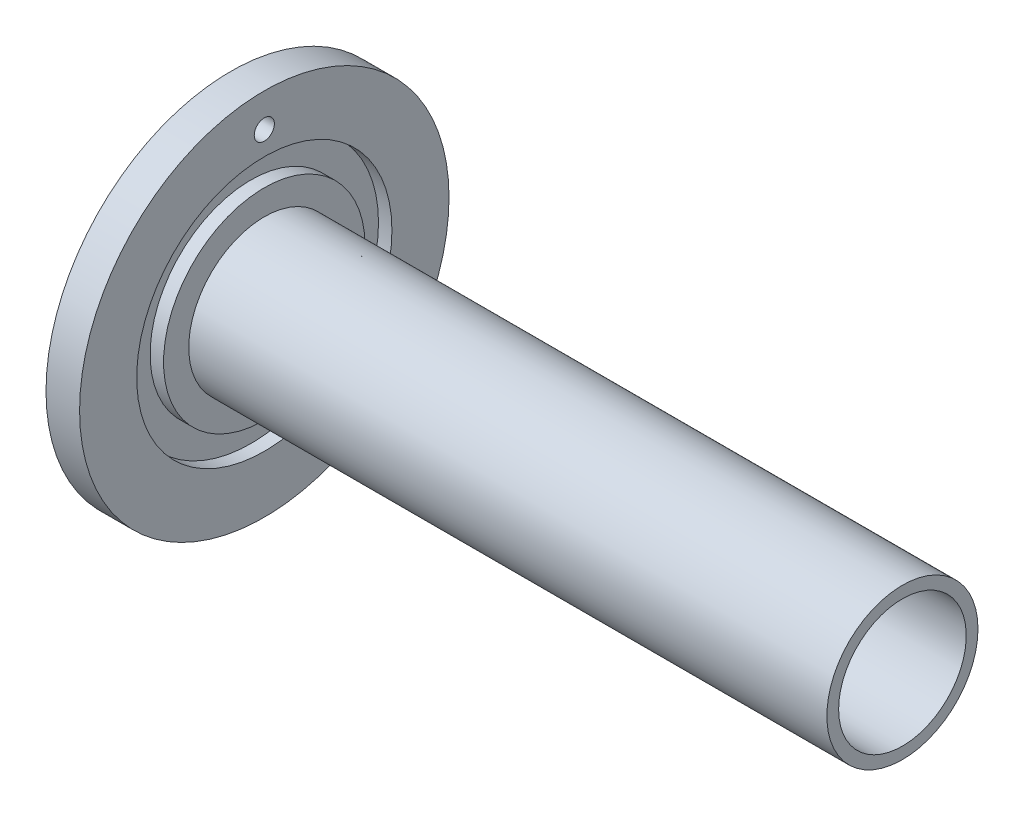
ISO-10303-21;
HEADER;
FILE_DESCRIPTION(('STEP AP214'),'2;1');
FILE_NAME('part.step','',(''),(''),'','','');
FILE_SCHEMA(('AUTOMOTIVE_DESIGN { 1 0 10303 214 1 1 1 1 }'));
ENDSEC;
DATA;
#1=APPLICATION_CONTEXT('core data for automotive mechanical design processes');
#2=APPLICATION_PROTOCOL_DEFINITION('international standard','automotive_design',2000,#1);
#3=PRODUCT_CONTEXT('',#1,'mechanical');
#4=PRODUCT('Part','Part','',(#3));
#5=PRODUCT_RELATED_PRODUCT_CATEGORY('part','',(#4));
#6=PRODUCT_DEFINITION_FORMATION('','',#4);
#7=PRODUCT_DEFINITION_CONTEXT('part definition',#1,'design');
#8=PRODUCT_DEFINITION('design','',#6,#7);
#9=PRODUCT_DEFINITION_SHAPE('','',#8);
#10=(LENGTH_UNIT() NAMED_UNIT(*) SI_UNIT(.MILLI.,.METRE.));
#11=(NAMED_UNIT(*) PLANE_ANGLE_UNIT() SI_UNIT($,.RADIAN.));
#12=(NAMED_UNIT(*) SI_UNIT($,.STERADIAN.) SOLID_ANGLE_UNIT());
#13=UNCERTAINTY_MEASURE_WITH_UNIT(LENGTH_MEASURE(1.E-05),#10,'distance_accuracy_value','');
#14=(GEOMETRIC_REPRESENTATION_CONTEXT(3) GLOBAL_UNCERTAINTY_ASSIGNED_CONTEXT((#13)) GLOBAL_UNIT_ASSIGNED_CONTEXT((#10,
#11,#12)) REPRESENTATION_CONTEXT('',''));
#15=CARTESIAN_POINT('',(0.,0.,0.));
#16=DIRECTION('',(0.,0.,1.));
#17=DIRECTION('',(1.,0.,0.));
#18=AXIS2_PLACEMENT_3D('',#15,#16,#17);
#19=CARTESIAN_POINT('',(1.,0.,0.));
#20=DIRECTION('',(-1.,0.,0.));
#21=DIRECTION('',(0.,0.,1.));
#22=AXIS2_PLACEMENT_3D('',#19,#20,#21);
#23=CYLINDRICAL_SURFACE('',#22,37.5);
#24=CARTESIAN_POINT('',(1.,0.,0.));
#25=DIRECTION('',(-1.,0.,0.));
#26=DIRECTION('',(0.,0.,1.));
#27=AXIS2_PLACEMENT_3D('',#24,#25,#26);
#28=CIRCLE('',#27,37.5);
#29=CARTESIAN_POINT('',(1.,-37.3125,3.74530956664458));
#30=VERTEX_POINT('',#29);
#31=CARTESIAN_POINT('',(1.,37.3125,3.74530956664458));
#32=VERTEX_POINT('',#31);
#33=EDGE_CURVE('E128',#30,#32,#28,.T.);
#34=ORIENTED_EDGE('',*,*,#33,.F.);
#35=DIRECTION('',(-1.,0.,0.));
#36=VECTOR('',#35,1.);
#37=CARTESIAN_POINT('',(1.,-37.3125,3.74530956664462));
#38=LINE('',#37,#36);
#39=CARTESIAN_POINT('',(0.,-37.3125,3.74530956664465));
#40=VERTEX_POINT('',#39);
#41=EDGE_CURVE('E125',#30,#40,#38,.T.);
#42=ORIENTED_EDGE('',*,*,#41,.T.);
#43=CARTESIAN_POINT('',(0.,0.,0.));
#44=DIRECTION('',(-1.,0.,0.));
#45=DIRECTION('',(0.,0.,1.));
#46=AXIS2_PLACEMENT_3D('',#43,#44,#45);
#47=CIRCLE('',#46,37.5);
#48=CARTESIAN_POINT('',(0.,37.3125,3.74530956664465));
#49=VERTEX_POINT('',#48);
#50=EDGE_CURVE('E119',#40,#49,#47,.T.);
#51=ORIENTED_EDGE('',*,*,#50,.T.);
#52=DIRECTION('',(-1.,0.,0.));
#53=VECTOR('',#52,1.);
#54=CARTESIAN_POINT('',(1.,37.3125,3.74530956664462));
#55=LINE('',#54,#53);
#56=EDGE_CURVE('E100',#49,#32,#55,.F.);
#57=ORIENTED_EDGE('',*,*,#56,.T.);
#58=EDGE_LOOP('',(#34,#42,#51,#57));
#59=FACE_BOUND('',#58,.T.);
#60=ADVANCED_FACE('F38',(#59),#23,.F.);
#61=CARTESIAN_POINT('',(1.,0.,0.));
#62=DIRECTION('',(-1.,0.,0.));
#63=DIRECTION('',(0.,0.,1.));
#64=AXIS2_PLACEMENT_3D('',#61,#62,#63);
#65=PLANE('',#64);
#66=CARTESIAN_POINT('',(1.,-34.,0.));
#67=DIRECTION('',(-1.,0.,0.));
#68=DIRECTION('',(0.,0.,1.));
#69=AXIS2_PLACEMENT_3D('',#66,#67,#68);
#70=CIRCLE('',#69,5.);
#71=CARTESIAN_POINT('',(1.,-30.3125,-3.37673566481002));
#72=VERTEX_POINT('',#71);
#73=CARTESIAN_POINT('',(1.,-37.3125,-3.74530956664458));
#74=VERTEX_POINT('',#73);
#75=EDGE_CURVE('E166',#72,#74,#70,.T.);
#76=ORIENTED_EDGE('',*,*,#75,.F.);
#77=CARTESIAN_POINT('',(1.,0.,0.));
#78=DIRECTION('',(-1.,0.,0.));
#79=DIRECTION('',(0.,0.,1.));
#80=AXIS2_PLACEMENT_3D('',#77,#78,#79);
#81=CIRCLE('',#80,30.5);
#82=CARTESIAN_POINT('',(1.,30.3125,-3.37673566481002));
#83=VERTEX_POINT('',#82);
#84=EDGE_CURVE('E126',#83,#72,#81,.T.);
#85=ORIENTED_EDGE('',*,*,#84,.F.);
#86=CARTESIAN_POINT('',(1.,34.,0.));
#87=DIRECTION('',(-1.,0.,0.));
#88=DIRECTION('',(0.,0.,1.));
#89=AXIS2_PLACEMENT_3D('',#86,#87,#88);
#90=CIRCLE('',#89,5.);
#91=CARTESIAN_POINT('',(1.,37.3125,-3.74530956664458));
#92=VERTEX_POINT('',#91);
#93=EDGE_CURVE('E111',#92,#83,#90,.T.);
#94=ORIENTED_EDGE('',*,*,#93,.F.);
#95=EDGE_CURVE('E139',#92,#74,#28,.T.);
#96=ORIENTED_EDGE('',*,*,#95,.T.);
#97=EDGE_LOOP('',(#76,#85,#94,#96));
#98=FACE_BOUND('',#97,.T.);
#99=ADVANCED_FACE('F174',(#98),#65,.T.);
#100=CARTESIAN_POINT('',(1.,0.,0.));
#101=DIRECTION('',(-1.,0.,0.));
#102=DIRECTION('',(0.,0.,1.));
#103=AXIS2_PLACEMENT_3D('',#100,#101,#102);
#104=CYLINDRICAL_SURFACE('',#103,30.5);
#105=DIRECTION('',(-1.,0.,0.));
#106=VECTOR('',#105,1.);
#107=CARTESIAN_POINT('',(1.,-30.3125,3.37673566481002));
#108=LINE('',#107,#106);
#109=CARTESIAN_POINT('',(1.,-30.3125,3.37673566481));
#110=VERTEX_POINT('',#109);
#111=CARTESIAN_POINT('',(0.,-30.3125,3.37673566481002));
#112=VERTEX_POINT('',#111);
#113=EDGE_CURVE('E11',#110,#112,#108,.T.);
#114=ORIENTED_EDGE('',*,*,#113,.F.);
#115=CARTESIAN_POINT('',(1.,30.3125,3.37673566481002));
#116=VERTEX_POINT('',#115);
#117=EDGE_CURVE('E130',#110,#116,#81,.T.);
#118=ORIENTED_EDGE('',*,*,#117,.T.);
#119=DIRECTION('',(-1.,0.,0.));
#120=VECTOR('',#119,1.);
#121=CARTESIAN_POINT('',(1.,30.3125,3.37673566481002));
#122=LINE('',#121,#120);
#123=CARTESIAN_POINT('',(0.,30.3125,3.37673566481002));
#124=VERTEX_POINT('',#123);
#125=EDGE_CURVE('E149',#124,#116,#122,.F.);
#126=ORIENTED_EDGE('',*,*,#125,.F.);
#127=CARTESIAN_POINT('',(0.,0.,0.));
#128=DIRECTION('',(-1.,0.,0.));
#129=DIRECTION('',(0.,0.,1.));
#130=AXIS2_PLACEMENT_3D('',#127,#128,#129);
#131=CIRCLE('',#130,30.5);
#132=EDGE_CURVE('E188',#112,#124,#131,.T.);
#133=ORIENTED_EDGE('',*,*,#132,.F.);
#134=EDGE_LOOP('',(#114,#118,#126,#133));
#135=FACE_BOUND('',#134,.T.);
#136=ADVANCED_FACE('F221',(#135),#104,.T.);
#137=CARTESIAN_POINT('',(10.,0.,0.));
#138=DIRECTION('',(1.,0.,0.));
#139=DIRECTION('',(0.,0.,-1.));
#140=AXIS2_PLACEMENT_3D('',#137,#138,#139);
#141=PLANE('',#140);
#142=CARTESIAN_POINT('',(10.,0.,-26.));
#143=DIRECTION('',(-1.,0.,0.));
#144=DIRECTION('',(0.,0.,1.));
#145=AXIS2_PLACEMENT_3D('',#142,#143,#144);
#146=CIRCLE('',#145,3.);
#147=CARTESIAN_POINT('',(10.,0.,-23.));
#148=VERTEX_POINT('',#147);
#149=EDGE_CURVE('E191',#148,#148,#146,.T.);
#150=ORIENTED_EDGE('',*,*,#149,.T.);
#151=EDGE_LOOP('',(#150));
#152=FACE_BOUND('',#151,.T.);
#153=CARTESIAN_POINT('',(10.,0.,0.));
#154=DIRECTION('',(1.,0.,0.));
#155=DIRECTION('',(0.,0.,-1.));
#156=AXIS2_PLACEMENT_3D('',#153,#154,#155);
#157=CIRCLE('',#156,22.5);
#158=CARTESIAN_POINT('',(10.,0.,-22.5));
#159=VERTEX_POINT('',#158);
#160=EDGE_CURVE('E146',#159,#159,#157,.T.);
#161=ORIENTED_EDGE('',*,*,#160,.F.);
#162=EDGE_LOOP('',(#161));
#163=FACE_BOUND('',#162,.T.);
#164=CARTESIAN_POINT('',(10.,0.,0.));
#165=DIRECTION('',(1.,0.,0.));
#166=DIRECTION('',(0.,0.,-1.));
#167=AXIS2_PLACEMENT_3D('',#164,#165,#166);
#168=CIRCLE('',#167,30.);
#169=CARTESIAN_POINT('',(10.,0.,-30.));
#170=VERTEX_POINT('',#169);
#171=EDGE_CURVE('E204',#170,#170,#168,.T.);
#172=ORIENTED_EDGE('',*,*,#171,.T.);
#173=EDGE_LOOP('',(#172));
#174=FACE_BOUND('',#173,.T.);
#175=ADVANCED_FACE('F261',(#152,#163,#174),#141,.T.);
#176=CARTESIAN_POINT('',(0.,0.,0.));
#177=DIRECTION('',(1.,0.,0.));
#178=DIRECTION('',(0.,0.,-1.));
#179=AXIS2_PLACEMENT_3D('',#176,#177,#178);
#180=PLANE('',#179);
#181=CARTESIAN_POINT('',(0.,0.,-26.));
#182=DIRECTION('',(-1.,0.,0.));
#183=DIRECTION('',(0.,0.,1.));
#184=AXIS2_PLACEMENT_3D('',#181,#182,#183);
#185=CIRCLE('',#184,3.);
#186=CARTESIAN_POINT('',(0.,0.,-23.));
#187=VERTEX_POINT('',#186);
#188=EDGE_CURVE('E229',#187,#187,#185,.T.);
#189=ORIENTED_EDGE('',*,*,#188,.F.);
#190=EDGE_LOOP('',(#189));
#191=FACE_BOUND('',#190,.T.);
#192=CARTESIAN_POINT('',(0.,0.,0.));
#193=DIRECTION('',(1.,0.,0.));
#194=DIRECTION('',(0.,0.,-1.));
#195=AXIS2_PLACEMENT_3D('',#192,#193,#194);
#196=CIRCLE('',#195,19.);
#197=CARTESIAN_POINT('',(0.,0.,-19.));
#198=VERTEX_POINT('',#197);
#199=EDGE_CURVE('E138',#198,#198,#196,.T.);
#200=ORIENTED_EDGE('',*,*,#199,.T.);
#201=EDGE_LOOP('',(#200));
#202=FACE_BOUND('',#201,.T.);
#203=CARTESIAN_POINT('',(0.,30.3125,-3.37673566481002));
#204=VERTEX_POINT('',#203);
#205=CARTESIAN_POINT('',(0.,-30.3125,-3.37673566481002));
#206=VERTEX_POINT('',#205);
#207=EDGE_CURVE('E183',#204,#206,#131,.T.);
#208=ORIENTED_EDGE('',*,*,#207,.T.);
#209=CARTESIAN_POINT('',(0.,-34.,0.));
#210=DIRECTION('',(-1.,0.,0.));
#211=DIRECTION('',(0.,0.,1.));
#212=AXIS2_PLACEMENT_3D('',#209,#210,#211);
#213=CIRCLE('',#212,5.);
#214=EDGE_CURVE('E52',#112,#206,#213,.T.);
#215=ORIENTED_EDGE('',*,*,#214,.F.);
#216=ORIENTED_EDGE('',*,*,#132,.T.);
#217=CARTESIAN_POINT('',(0.,34.,0.));
#218=DIRECTION('',(-1.,0.,0.));
#219=DIRECTION('',(0.,0.,1.));
#220=AXIS2_PLACEMENT_3D('',#217,#218,#219);
#221=CIRCLE('',#220,5.);
#222=EDGE_CURVE('E60',#204,#124,#221,.T.);
#223=ORIENTED_EDGE('',*,*,#222,.F.);
#224=EDGE_LOOP('',(#208,#215,#216,#223));
#225=FACE_BOUND('',#224,.T.);
#226=ADVANCED_FACE('F186',(#191,#202,#225),#180,.F.);
#227=CARTESIAN_POINT('',(10.,0.,0.));
#228=DIRECTION('',(-1.,0.,0.));
#229=DIRECTION('',(0.,0.,1.));
#230=AXIS2_PLACEMENT_3D('',#227,#228,#229);
#231=CYLINDRICAL_SURFACE('',#230,55.);
#232=CARTESIAN_POINT('',(10.,0.,0.));
#233=DIRECTION('',(1.,0.,0.));
#234=DIRECTION('',(0.,0.,-1.));
#235=AXIS2_PLACEMENT_3D('',#232,#233,#234);
#236=CIRCLE('',#235,55.);
#237=CARTESIAN_POINT('',(10.,0.,-55.));
#238=VERTEX_POINT('',#237);
#239=EDGE_CURVE('E150',#238,#238,#236,.T.);
#240=ORIENTED_EDGE('',*,*,#239,.F.);
#241=EDGE_LOOP('',(#240));
#242=FACE_BOUND('',#241,.T.);
#243=CARTESIAN_POINT('',(0.,0.,0.));
#244=DIRECTION('',(1.,0.,0.));
#245=DIRECTION('',(0.,0.,-1.));
#246=AXIS2_PLACEMENT_3D('',#243,#244,#245);
#247=CIRCLE('',#246,55.);
#248=CARTESIAN_POINT('',(0.,0.,-55.));
#249=VERTEX_POINT('',#248);
#250=EDGE_CURVE('E145',#249,#249,#247,.T.);
#251=ORIENTED_EDGE('',*,*,#250,.T.);
#252=EDGE_LOOP('',(#251));
#253=FACE_BOUND('',#252,.T.);
#254=ADVANCED_FACE('F40',(#242,#253),#231,.T.);
#255=CARTESIAN_POINT('',(10.,45.,0.));
#256=DIRECTION('',(-1.,0.,0.));
#257=DIRECTION('',(0.,0.,1.));
#258=AXIS2_PLACEMENT_3D('',#255,#256,#257);
#259=CIRCLE('',#258,3.);
#260=CARTESIAN_POINT('',(10.,45.,3.));
#261=VERTEX_POINT('',#260);
#262=EDGE_CURVE('E232',#261,#261,#259,.T.);
#263=ORIENTED_EDGE('',*,*,#262,.T.);
#264=EDGE_LOOP('',(#263));
#265=FACE_BOUND('',#264,.T.);
#266=CARTESIAN_POINT('',(10.,0.,0.));
#267=DIRECTION('',(1.,0.,0.));
#268=DIRECTION('',(0.,0.,-1.));
#269=AXIS2_PLACEMENT_3D('',#266,#267,#268);
#270=CIRCLE('',#269,38.);
#271=CARTESIAN_POINT('',(10.,0.,-38.));
#272=VERTEX_POINT('',#271);
#273=EDGE_CURVE('E210',#272,#272,#270,.T.);
#274=ORIENTED_EDGE('',*,*,#273,.F.);
#275=EDGE_LOOP('',(#274));
#276=FACE_BOUND('',#275,.T.);
#277=ORIENTED_EDGE('',*,*,#239,.T.);
#278=EDGE_LOOP('',(#277));
#279=FACE_BOUND('',#278,.T.);
#280=ADVANCED_FACE('F241',(#265,#276,#279),#141,.T.);
#281=CARTESIAN_POINT('',(0.,45.,0.));
#282=DIRECTION('',(-1.,0.,0.));
#283=DIRECTION('',(0.,0.,1.));
#284=AXIS2_PLACEMENT_3D('',#281,#282,#283);
#285=CIRCLE('',#284,3.);
#286=CARTESIAN_POINT('',(0.,45.,3.));
#287=VERTEX_POINT('',#286);
#288=EDGE_CURVE('E235',#287,#287,#285,.T.);
#289=ORIENTED_EDGE('',*,*,#288,.F.);
#290=EDGE_LOOP('',(#289));
#291=FACE_BOUND('',#290,.T.);
#292=ORIENTED_EDGE('',*,*,#50,.F.);
#293=CARTESIAN_POINT('',(0.,-37.3125,-3.74530956664465));
#294=VERTEX_POINT('',#293);
#295=EDGE_CURVE('E122',#294,#40,#213,.T.);
#296=ORIENTED_EDGE('',*,*,#295,.F.);
#297=CARTESIAN_POINT('',(0.,37.3125,-3.74530956664465));
#298=VERTEX_POINT('',#297);
#299=EDGE_CURVE('E121',#298,#294,#47,.T.);
#300=ORIENTED_EDGE('',*,*,#299,.F.);
#301=EDGE_CURVE('E103',#49,#298,#221,.T.);
#302=ORIENTED_EDGE('',*,*,#301,.F.);
#303=EDGE_LOOP('',(#292,#296,#300,#302));
#304=FACE_BOUND('',#303,.T.);
#305=ORIENTED_EDGE('',*,*,#250,.F.);
#306=EDGE_LOOP('',(#305));
#307=FACE_BOUND('',#306,.T.);
#308=ADVANCED_FACE('F116',(#291,#304,#307),#180,.F.);
#309=CARTESIAN_POINT('',(200.,0.,0.));
#310=DIRECTION('',(-1.,0.,0.));
#311=DIRECTION('',(0.,0.,1.));
#312=AXIS2_PLACEMENT_3D('',#309,#310,#311);
#313=CYLINDRICAL_SURFACE('',#312,22.5);
#314=CARTESIAN_POINT('',(200.,0.,0.));
#315=DIRECTION('',(1.,0.,0.));
#316=DIRECTION('',(0.,0.,-1.));
#317=AXIS2_PLACEMENT_3D('',#314,#315,#316);
#318=CIRCLE('',#317,22.5);
#319=CARTESIAN_POINT('',(200.,0.,-22.5));
#320=VERTEX_POINT('',#319);
#321=EDGE_CURVE('E142',#320,#320,#318,.T.);
#322=ORIENTED_EDGE('',*,*,#321,.F.);
#323=EDGE_LOOP('',(#322));
#324=FACE_BOUND('',#323,.T.);
#325=ORIENTED_EDGE('',*,*,#160,.T.);
#326=EDGE_LOOP('',(#325));
#327=FACE_BOUND('',#326,.T.);
#328=ADVANCED_FACE('F252',(#324,#327),#313,.T.);
#329=CARTESIAN_POINT('',(200.,0.,0.));
#330=DIRECTION('',(1.,0.,0.));
#331=DIRECTION('',(0.,0.,-1.));
#332=AXIS2_PLACEMENT_3D('',#329,#330,#331);
#333=PLANE('',#332);
#334=CARTESIAN_POINT('',(200.,0.,0.));
#335=DIRECTION('',(-1.,0.,0.));
#336=DIRECTION('',(0.,0.,1.));
#337=AXIS2_PLACEMENT_3D('',#334,#335,#336);
#338=CIRCLE('',#337,19.);
#339=CARTESIAN_POINT('',(200.,0.,19.));
#340=VERTEX_POINT('',#339);
#341=EDGE_CURVE('E135',#340,#340,#338,.T.);
#342=ORIENTED_EDGE('',*,*,#341,.T.);
#343=EDGE_LOOP('',(#342));
#344=FACE_BOUND('',#343,.T.);
#345=ORIENTED_EDGE('',*,*,#321,.T.);
#346=EDGE_LOOP('',(#345));
#347=FACE_BOUND('',#346,.T.);
#348=ADVANCED_FACE('F257',(#344,#347),#333,.T.);
#349=CARTESIAN_POINT('',(200.,0.,0.));
#350=DIRECTION('',(-1.,0.,0.));
#351=DIRECTION('',(0.,0.,1.));
#352=AXIS2_PLACEMENT_3D('',#349,#350,#351);
#353=CYLINDRICAL_SURFACE('',#352,19.);
#354=ORIENTED_EDGE('',*,*,#341,.F.);
#355=EDGE_LOOP('',(#354));
#356=FACE_BOUND('',#355,.T.);
#357=ORIENTED_EDGE('',*,*,#199,.F.);
#358=EDGE_LOOP('',(#357));
#359=FACE_BOUND('',#358,.T.);
#360=ADVANCED_FACE('F273',(#356,#359),#353,.F.);
#361=ORIENTED_EDGE('',*,*,#299,.T.);
#362=DIRECTION('',(-1.,0.,0.));
#363=VECTOR('',#362,1.);
#364=CARTESIAN_POINT('',(1.,-37.3125,-3.74530956664462));
#365=LINE('',#364,#363);
#366=EDGE_CURVE('E177',#294,#74,#365,.F.);
#367=ORIENTED_EDGE('',*,*,#366,.T.);
#368=ORIENTED_EDGE('',*,*,#95,.F.);
#369=DIRECTION('',(-1.,0.,0.));
#370=VECTOR('',#369,1.);
#371=CARTESIAN_POINT('',(1.,37.3125,-3.74530956664462));
#372=LINE('',#371,#370);
#373=EDGE_CURVE('E178',#92,#298,#372,.T.);
#374=ORIENTED_EDGE('',*,*,#373,.T.);
#375=EDGE_LOOP('',(#361,#367,#368,#374));
#376=FACE_BOUND('',#375,.T.);
#377=ADVANCED_FACE('F266',(#376),#23,.F.);
#378=EDGE_CURVE('E180',#30,#110,#70,.T.);
#379=ORIENTED_EDGE('',*,*,#378,.F.);
#380=ORIENTED_EDGE('',*,*,#33,.T.);
#381=EDGE_CURVE('E106',#116,#32,#90,.T.);
#382=ORIENTED_EDGE('',*,*,#381,.F.);
#383=ORIENTED_EDGE('',*,*,#117,.F.);
#384=EDGE_LOOP('',(#379,#380,#382,#383));
#385=FACE_BOUND('',#384,.T.);
#386=ADVANCED_FACE('F224',(#385),#65,.T.);
#387=DIRECTION('',(-1.,0.,0.));
#388=VECTOR('',#387,1.);
#389=CARTESIAN_POINT('',(1.,-30.3125,-3.37673566481002));
#390=LINE('',#389,#388);
#391=EDGE_CURVE('E46',#206,#72,#390,.F.);
#392=ORIENTED_EDGE('',*,*,#391,.F.);
#393=ORIENTED_EDGE('',*,*,#207,.F.);
#394=DIRECTION('',(-1.,0.,0.));
#395=VECTOR('',#394,1.);
#396=CARTESIAN_POINT('',(1.,30.3125,-3.37673566481002));
#397=LINE('',#396,#395);
#398=EDGE_CURVE('E163',#83,#204,#397,.T.);
#399=ORIENTED_EDGE('',*,*,#398,.F.);
#400=ORIENTED_EDGE('',*,*,#84,.T.);
#401=EDGE_LOOP('',(#392,#393,#399,#400));
#402=FACE_BOUND('',#401,.T.);
#403=ADVANCED_FACE('F182',(#402),#104,.T.);
#404=CARTESIAN_POINT('',(6.,0.,0.));
#405=DIRECTION('',(1.,0.,0.));
#406=DIRECTION('',(0.,0.,-1.));
#407=AXIS2_PLACEMENT_3D('',#404,#405,#406);
#408=CYLINDRICAL_SURFACE('',#407,38.);
#409=CARTESIAN_POINT('',(6.,0.,0.));
#410=DIRECTION('',(1.,0.,0.));
#411=DIRECTION('',(0.,0.,-1.));
#412=AXIS2_PLACEMENT_3D('',#409,#410,#411);
#413=CIRCLE('',#412,38.);
#414=CARTESIAN_POINT('',(6.,0.,-38.));
#415=VERTEX_POINT('',#414);
#416=EDGE_CURVE('E213',#415,#415,#413,.T.);
#417=ORIENTED_EDGE('',*,*,#416,.F.);
#418=EDGE_LOOP('',(#417));
#419=FACE_BOUND('',#418,.T.);
#420=ORIENTED_EDGE('',*,*,#273,.T.);
#421=EDGE_LOOP('',(#420));
#422=FACE_BOUND('',#421,.T.);
#423=ADVANCED_FACE('F311',(#419,#422),#408,.F.);
#424=CARTESIAN_POINT('',(6.,0.,0.));
#425=DIRECTION('',(1.,0.,0.));
#426=DIRECTION('',(0.,0.,-1.));
#427=AXIS2_PLACEMENT_3D('',#424,#425,#426);
#428=PLANE('',#427);
#429=CARTESIAN_POINT('',(6.,0.,0.));
#430=DIRECTION('',(1.,0.,0.));
#431=DIRECTION('',(0.,0.,-1.));
#432=AXIS2_PLACEMENT_3D('',#429,#430,#431);
#433=CIRCLE('',#432,30.);
#434=CARTESIAN_POINT('',(6.,0.,-30.));
#435=VERTEX_POINT('',#434);
#436=EDGE_CURVE('E207',#435,#435,#433,.T.);
#437=ORIENTED_EDGE('',*,*,#436,.F.);
#438=EDGE_LOOP('',(#437));
#439=FACE_BOUND('',#438,.T.);
#440=ORIENTED_EDGE('',*,*,#416,.T.);
#441=EDGE_LOOP('',(#440));
#442=FACE_BOUND('',#441,.T.);
#443=ADVANCED_FACE('F301',(#439,#442),#428,.T.);
#444=CARTESIAN_POINT('',(6.,0.,0.));
#445=DIRECTION('',(1.,0.,0.));
#446=DIRECTION('',(0.,0.,-1.));
#447=AXIS2_PLACEMENT_3D('',#444,#445,#446);
#448=CYLINDRICAL_SURFACE('',#447,30.);
#449=ORIENTED_EDGE('',*,*,#436,.T.);
#450=EDGE_LOOP('',(#449));
#451=FACE_BOUND('',#450,.T.);
#452=ORIENTED_EDGE('',*,*,#171,.F.);
#453=EDGE_LOOP('',(#452));
#454=FACE_BOUND('',#453,.T.);
#455=ADVANCED_FACE('F299',(#451,#454),#448,.T.);
#456=CARTESIAN_POINT('',(2.,34.,0.));
#457=DIRECTION('',(-1.,0.,0.));
#458=DIRECTION('',(0.,0.,1.));
#459=AXIS2_PLACEMENT_3D('',#456,#457,#458);
#460=CYLINDRICAL_SURFACE('',#459,5.);
#461=CARTESIAN_POINT('',(2.,34.,0.));
#462=DIRECTION('',(-1.,0.,0.));
#463=DIRECTION('',(0.,0.,1.));
#464=AXIS2_PLACEMENT_3D('',#461,#462,#463);
#465=CIRCLE('',#464,5.);
#466=CARTESIAN_POINT('',(2.,34.,5.));
#467=VERTEX_POINT('',#466);
#468=EDGE_CURVE('E189',#467,#467,#465,.T.);
#469=ORIENTED_EDGE('',*,*,#468,.F.);
#470=EDGE_LOOP('',(#469));
#471=FACE_BOUND('',#470,.T.);
#472=ORIENTED_EDGE('',*,*,#93,.T.);
#473=ORIENTED_EDGE('',*,*,#398,.T.);
#474=ORIENTED_EDGE('',*,*,#222,.T.);
#475=ORIENTED_EDGE('',*,*,#125,.T.);
#476=ORIENTED_EDGE('',*,*,#381,.T.);
#477=ORIENTED_EDGE('',*,*,#56,.F.);
#478=ORIENTED_EDGE('',*,*,#301,.T.);
#479=ORIENTED_EDGE('',*,*,#373,.F.);
#480=EDGE_LOOP('',(#472,#473,#474,#475,#476,#477,#478,#479));
#481=FACE_BOUND('',#480,.T.);
#482=ADVANCED_FACE('F102',(#471,#481),#460,.F.);
#483=CARTESIAN_POINT('',(2.,34.,0.));
#484=DIRECTION('',(-1.,0.,0.));
#485=DIRECTION('',(0.,0.,1.));
#486=AXIS2_PLACEMENT_3D('',#483,#484,#485);
#487=PLANE('',#486);
#488=ORIENTED_EDGE('',*,*,#468,.T.);
#489=EDGE_LOOP('',(#488));
#490=FACE_BOUND('',#489,.T.);
#491=CARTESIAN_POINT('',(2.,34.,0.));
#492=DIRECTION('',(-1.,0.,0.));
#493=DIRECTION('',(0.,0.,1.));
#494=AXIS2_PLACEMENT_3D('',#491,#492,#493);
#495=CIRCLE('',#494,2.5);
#496=CARTESIAN_POINT('',(2.,34.,2.5));
#497=VERTEX_POINT('',#496);
#498=EDGE_CURVE('E155',#497,#497,#495,.F.);
#499=ORIENTED_EDGE('',*,*,#498,.T.);
#500=EDGE_LOOP('',(#499));
#501=FACE_BOUND('',#500,.T.);
#502=ADVANCED_FACE('F308',(#490,#501),#487,.T.);
#503=CARTESIAN_POINT('',(2.,-34.,0.));
#504=DIRECTION('',(-1.,0.,0.));
#505=DIRECTION('',(0.,0.,1.));
#506=AXIS2_PLACEMENT_3D('',#503,#504,#505);
#507=CYLINDRICAL_SURFACE('',#506,5.);
#508=CARTESIAN_POINT('',(2.,-34.,0.));
#509=DIRECTION('',(-1.,0.,0.));
#510=DIRECTION('',(0.,0.,1.));
#511=AXIS2_PLACEMENT_3D('',#508,#509,#510);
#512=CIRCLE('',#511,5.);
#513=CARTESIAN_POINT('',(2.,-34.,5.));
#514=VERTEX_POINT('',#513);
#515=EDGE_CURVE('E159',#514,#514,#512,.T.);
#516=ORIENTED_EDGE('',*,*,#515,.F.);
#517=EDGE_LOOP('',(#516));
#518=FACE_BOUND('',#517,.T.);
#519=ORIENTED_EDGE('',*,*,#378,.T.);
#520=ORIENTED_EDGE('',*,*,#113,.T.);
#521=ORIENTED_EDGE('',*,*,#214,.T.);
#522=ORIENTED_EDGE('',*,*,#391,.T.);
#523=ORIENTED_EDGE('',*,*,#75,.T.);
#524=ORIENTED_EDGE('',*,*,#366,.F.);
#525=ORIENTED_EDGE('',*,*,#295,.T.);
#526=ORIENTED_EDGE('',*,*,#41,.F.);
#527=EDGE_LOOP('',(#519,#520,#521,#522,#523,#524,#525,#526));
#528=FACE_BOUND('',#527,.T.);
#529=ADVANCED_FACE('F165',(#518,#528),#507,.F.);
#530=CARTESIAN_POINT('',(2.,-34.,0.));
#531=DIRECTION('',(-1.,0.,0.));
#532=DIRECTION('',(0.,0.,1.));
#533=AXIS2_PLACEMENT_3D('',#530,#531,#532);
#534=PLANE('',#533);
#535=ORIENTED_EDGE('',*,*,#515,.T.);
#536=EDGE_LOOP('',(#535));
#537=FACE_BOUND('',#536,.T.);
#538=CARTESIAN_POINT('',(2.,-34.,0.));
#539=DIRECTION('',(-1.,0.,0.));
#540=DIRECTION('',(0.,0.,1.));
#541=AXIS2_PLACEMENT_3D('',#538,#539,#540);
#542=CIRCLE('',#541,2.5);
#543=CARTESIAN_POINT('',(2.,-34.,2.5));
#544=VERTEX_POINT('',#543);
#545=EDGE_CURVE('E158',#544,#544,#542,.F.);
#546=ORIENTED_EDGE('',*,*,#545,.T.);
#547=EDGE_LOOP('',(#546));
#548=FACE_BOUND('',#547,.T.);
#549=ADVANCED_FACE('F398',(#537,#548),#534,.T.);
#550=CARTESIAN_POINT('',(4.,34.,0.));
#551=DIRECTION('',(-1.,0.,0.));
#552=DIRECTION('',(0.,0.,1.));
#553=AXIS2_PLACEMENT_3D('',#550,#551,#552);
#554=PLANE('',#553);
#555=CARTESIAN_POINT('',(4.,34.,0.));
#556=DIRECTION('',(-1.,0.,0.));
#557=DIRECTION('',(0.,0.,1.));
#558=AXIS2_PLACEMENT_3D('',#555,#556,#557);
#559=CIRCLE('',#558,2.5);
#560=CARTESIAN_POINT('',(4.,34.,2.5));
#561=VERTEX_POINT('',#560);
#562=EDGE_CURVE('E201',#561,#561,#559,.T.);
#563=ORIENTED_EDGE('',*,*,#562,.T.);
#564=EDGE_LOOP('',(#563));
#565=FACE_BOUND('',#564,.T.);
#566=ADVANCED_FACE('F390',(#565),#554,.T.);
#567=CARTESIAN_POINT('',(4.,34.,0.));
#568=DIRECTION('',(-1.,0.,0.));
#569=DIRECTION('',(0.,0.,1.));
#570=AXIS2_PLACEMENT_3D('',#567,#568,#569);
#571=CYLINDRICAL_SURFACE('',#570,2.5);
#572=ORIENTED_EDGE('',*,*,#562,.F.);
#573=EDGE_LOOP('',(#572));
#574=FACE_BOUND('',#573,.T.);
#575=ORIENTED_EDGE('',*,*,#498,.F.);
#576=EDGE_LOOP('',(#575));
#577=FACE_BOUND('',#576,.T.);
#578=ADVANCED_FACE('F383',(#574,#577),#571,.F.);
#579=CARTESIAN_POINT('',(4.,-34.,0.));
#580=DIRECTION('',(-1.,0.,0.));
#581=DIRECTION('',(0.,0.,1.));
#582=AXIS2_PLACEMENT_3D('',#579,#580,#581);
#583=PLANE('',#582);
#584=CARTESIAN_POINT('',(4.,-34.,0.));
#585=DIRECTION('',(-1.,0.,0.));
#586=DIRECTION('',(0.,0.,1.));
#587=AXIS2_PLACEMENT_3D('',#584,#585,#586);
#588=CIRCLE('',#587,2.5);
#589=CARTESIAN_POINT('',(4.,-34.,2.5));
#590=VERTEX_POINT('',#589);
#591=EDGE_CURVE('E200',#590,#590,#588,.T.);
#592=ORIENTED_EDGE('',*,*,#591,.T.);
#593=EDGE_LOOP('',(#592));
#594=FACE_BOUND('',#593,.T.);
#595=ADVANCED_FACE('F315',(#594),#583,.T.);
#596=CARTESIAN_POINT('',(4.,-34.,0.));
#597=DIRECTION('',(-1.,0.,0.));
#598=DIRECTION('',(0.,0.,1.));
#599=AXIS2_PLACEMENT_3D('',#596,#597,#598);
#600=CYLINDRICAL_SURFACE('',#599,2.5);
#601=ORIENTED_EDGE('',*,*,#591,.F.);
#602=EDGE_LOOP('',(#601));
#603=FACE_BOUND('',#602,.T.);
#604=ORIENTED_EDGE('',*,*,#545,.F.);
#605=EDGE_LOOP('',(#604));
#606=FACE_BOUND('',#605,.T.);
#607=ADVANCED_FACE('F371',(#603,#606),#600,.F.);
#608=CARTESIAN_POINT('',(10.,0.,-26.));
#609=DIRECTION('',(-1.,0.,0.));
#610=DIRECTION('',(0.,0.,1.));
#611=AXIS2_PLACEMENT_3D('',#608,#609,#610);
#612=CYLINDRICAL_SURFACE('',#611,3.);
#613=ORIENTED_EDGE('',*,*,#149,.F.);
#614=EDGE_LOOP('',(#613));
#615=FACE_BOUND('',#614,.T.);
#616=ORIENTED_EDGE('',*,*,#188,.T.);
#617=EDGE_LOOP('',(#616));
#618=FACE_BOUND('',#617,.T.);
#619=ADVANCED_FACE('F247',(#615,#618),#612,.F.);
#620=CARTESIAN_POINT('',(10.,45.,0.));
#621=DIRECTION('',(-1.,0.,0.));
#622=DIRECTION('',(0.,0.,1.));
#623=AXIS2_PLACEMENT_3D('',#620,#621,#622);
#624=CYLINDRICAL_SURFACE('',#623,3.);
#625=ORIENTED_EDGE('',*,*,#262,.F.);
#626=EDGE_LOOP('',(#625));
#627=FACE_BOUND('',#626,.T.);
#628=ORIENTED_EDGE('',*,*,#288,.T.);
#629=EDGE_LOOP('',(#628));
#630=FACE_BOUND('',#629,.T.);
#631=ADVANCED_FACE('F244',(#627,#630),#624,.F.);
#632=CLOSED_SHELL('',(#60,#99,#136,#175,#226,#254,#280,#308,#328,#348,#360,#377,#386,#403,#423,
#443,#455,#482,#502,#529,#549,#566,#578,#595,#607,#619,#631));
#633=MANIFOLD_SOLID_BREP('B2',#632);
#634=ADVANCED_BREP_SHAPE_REPRESENTATION('',(#18,#633),#14);
#635=SHAPE_DEFINITION_REPRESENTATION(#9,#634);
ENDSEC;
END-ISO-10303-21;
